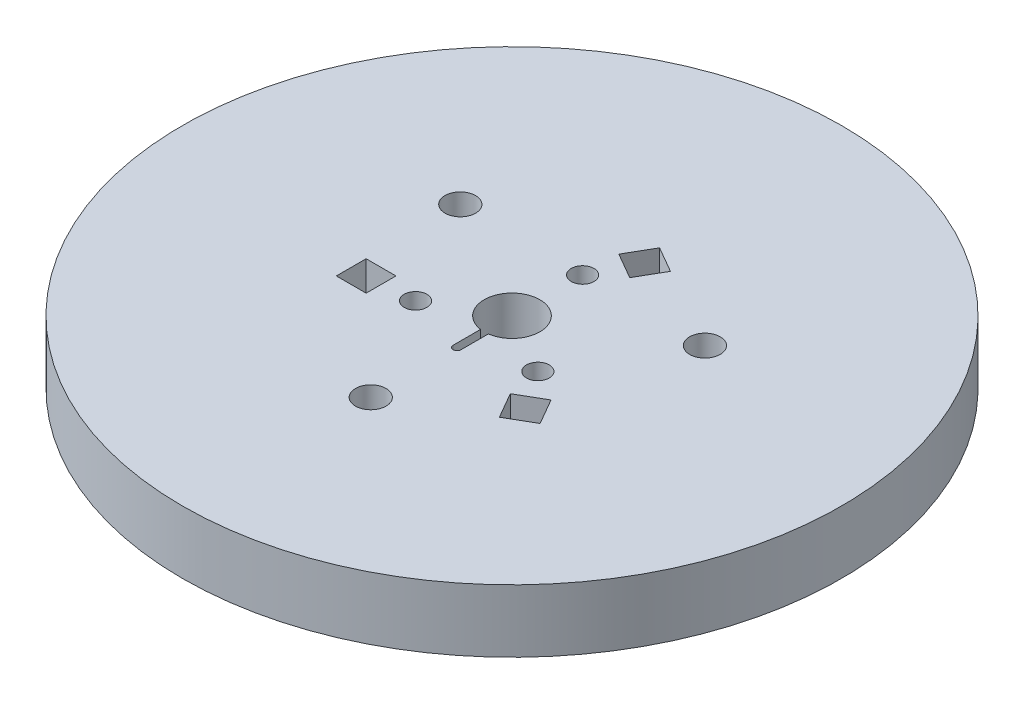
ISO-10303-21;
HEADER;
FILE_DESCRIPTION(('STEP AP214'),'2;1');
FILE_NAME('part.step','',(''),(''),'','','');
FILE_SCHEMA(('AUTOMOTIVE_DESIGN { 1 0 10303 214 1 1 1 1 }'));
ENDSEC;
DATA;
#1=APPLICATION_CONTEXT('core data for automotive mechanical design processes');
#2=APPLICATION_PROTOCOL_DEFINITION('international standard','automotive_design',2000,#1);
#3=PRODUCT_CONTEXT('',#1,'mechanical');
#4=PRODUCT('Part','Part','',(#3));
#5=PRODUCT_RELATED_PRODUCT_CATEGORY('part','',(#4));
#6=PRODUCT_DEFINITION_FORMATION('','',#4);
#7=PRODUCT_DEFINITION_CONTEXT('part definition',#1,'design');
#8=PRODUCT_DEFINITION('design','',#6,#7);
#9=PRODUCT_DEFINITION_SHAPE('','',#8);
#10=(LENGTH_UNIT() NAMED_UNIT(*) SI_UNIT(.MILLI.,.METRE.));
#11=(NAMED_UNIT(*) PLANE_ANGLE_UNIT() SI_UNIT($,.RADIAN.));
#12=(NAMED_UNIT(*) SI_UNIT($,.STERADIAN.) SOLID_ANGLE_UNIT());
#13=UNCERTAINTY_MEASURE_WITH_UNIT(LENGTH_MEASURE(1.E-05),#10,'distance_accuracy_value','');
#14=(GEOMETRIC_REPRESENTATION_CONTEXT(3) GLOBAL_UNCERTAINTY_ASSIGNED_CONTEXT((#13)) GLOBAL_UNIT_ASSIGNED_CONTEXT((#10,
#11,#12)) REPRESENTATION_CONTEXT('',''));
#15=CARTESIAN_POINT('',(0.,0.,0.));
#16=DIRECTION('',(0.,0.,1.));
#17=DIRECTION('',(1.,0.,0.));
#18=AXIS2_PLACEMENT_3D('',#15,#16,#17);
#19=CARTESIAN_POINT('',(0.,8.,0.));
#20=DIRECTION('',(0.,1.,0.));
#21=DIRECTION('',(0.,0.,-1.));
#22=AXIS2_PLACEMENT_3D('',#19,#20,#21);
#23=PLANE('',#22);
#24=DIRECTION('',(0.500000000000008,0.,-0.866025403784434));
#25=VECTOR('',#24,1.);
#26=CARTESIAN_POINT('',(1.90525588832576,8.,-16.9));
#27=LINE('',#26,#25);
#28=CARTESIAN_POINT('',(0.00525588832573222,8.,-13.6091034656191));
#29=VERTEX_POINT('',#28);
#30=CARTESIAN_POINT('',(1.90525588832576,8.,-16.9));
#31=VERTEX_POINT('',#30);
#32=EDGE_CURVE('E296',#29,#31,#27,.T.);
#33=ORIENTED_EDGE('',*,*,#32,.T.);
#34=DIRECTION('',(0.866025403784436,0.,0.500000000000005));
#35=VECTOR('',#34,1.);
#36=CARTESIAN_POINT('',(1.90525588832576,8.,-16.9));
#37=LINE('',#36,#35);
#38=CARTESIAN_POINT('',(5.19615242270662,8.,-15.));
#39=VERTEX_POINT('',#38);
#40=EDGE_CURVE('E270',#31,#39,#37,.T.);
#41=ORIENTED_EDGE('',*,*,#40,.T.);
#42=DIRECTION('',(-0.500000000000008,0.,0.866025403784434));
#43=VECTOR('',#42,1.);
#44=CARTESIAN_POINT('',(5.19615242270662,8.,-15.));
#45=LINE('',#44,#43);
#46=CARTESIAN_POINT('',(3.29615242270659,8.,-11.7091034656191));
#47=VERTEX_POINT('',#46);
#48=EDGE_CURVE('E277',#39,#47,#45,.T.);
#49=ORIENTED_EDGE('',*,*,#48,.T.);
#50=DIRECTION('',(-0.866025403784436,0.,-0.500000000000004));
#51=VECTOR('',#50,1.);
#52=CARTESIAN_POINT('',(0.00525588832573222,8.,-13.6091034656191));
#53=LINE('',#52,#51);
#54=EDGE_CURVE('E272',#47,#29,#53,.T.);
#55=ORIENTED_EDGE('',*,*,#54,.T.);
#56=EDGE_LOOP('',(#33,#41,#49,#55));
#57=FACE_BOUND('',#56,.T.);
#58=DIRECTION('',(-1.,0.,0.));
#59=VECTOR('',#58,1.);
#60=CARTESIAN_POINT('',(-15.5884572681199,8.,6.80000000000006));
#61=LINE('',#60,#59);
#62=CARTESIAN_POINT('',(-11.7884572681199,8.,6.80000000000008));
#63=VERTEX_POINT('',#62);
#64=CARTESIAN_POINT('',(-15.5884572681199,8.,6.80000000000006));
#65=VERTEX_POINT('',#64);
#66=EDGE_CURVE('E281',#63,#65,#61,.T.);
#67=ORIENTED_EDGE('',*,*,#66,.T.);
#68=DIRECTION('',(0.,0.,-1.));
#69=VECTOR('',#68,1.);
#70=CARTESIAN_POINT('',(-15.5884572681199,8.,6.80000000000006));
#71=LINE('',#70,#69);
#72=CARTESIAN_POINT('',(-15.5884572681199,8.,3.00000000000006));
#73=VERTEX_POINT('',#72);
#74=EDGE_CURVE('E284',#65,#73,#71,.T.);
#75=ORIENTED_EDGE('',*,*,#74,.T.);
#76=DIRECTION('',(1.,0.,0.));
#77=VECTOR('',#76,1.);
#78=CARTESIAN_POINT('',(-15.5884572681199,8.,3.00000000000006));
#79=LINE('',#78,#77);
#80=CARTESIAN_POINT('',(-11.7884572681199,8.,3.00000000000008));
#81=VERTEX_POINT('',#80);
#82=EDGE_CURVE('E288',#73,#81,#79,.T.);
#83=ORIENTED_EDGE('',*,*,#82,.T.);
#84=DIRECTION('',(0.,0.,1.));
#85=VECTOR('',#84,1.);
#86=CARTESIAN_POINT('',(-11.7884572681199,8.,6.80000000000008));
#87=LINE('',#86,#85);
#88=EDGE_CURVE('E291',#81,#63,#87,.T.);
#89=ORIENTED_EDGE('',*,*,#88,.T.);
#90=EDGE_LOOP('',(#67,#75,#83,#89));
#91=FACE_BOUND('',#90,.T.);
#92=DIRECTION('',(0.5,0.,0.866025403784439));
#93=VECTOR('',#92,1.);
#94=CARTESIAN_POINT('',(13.6832013797942,8.,10.0999999999999));
#95=LINE('',#94,#93);
#96=CARTESIAN_POINT('',(11.7832013797942,8.,6.80910346561901));
#97=VERTEX_POINT('',#96);
#98=CARTESIAN_POINT('',(13.6832013797942,8.,10.0999999999999));
#99=VERTEX_POINT('',#98);
#100=EDGE_CURVE('E302',#97,#99,#95,.T.);
#101=ORIENTED_EDGE('',*,*,#100,.T.);
#102=DIRECTION('',(-0.866025403784436,0.,0.500000000000004));
#103=VECTOR('',#102,1.);
#104=CARTESIAN_POINT('',(13.6832013797942,8.,10.0999999999999));
#105=LINE('',#104,#103);
#106=CARTESIAN_POINT('',(10.3923048454134,8.,11.9999999999999));
#107=VERTEX_POINT('',#106);
#108=EDGE_CURVE('E305',#99,#107,#105,.T.);
#109=ORIENTED_EDGE('',*,*,#108,.T.);
#110=DIRECTION('',(-0.5,0.,-0.866025403784439));
#111=VECTOR('',#110,1.);
#112=CARTESIAN_POINT('',(10.3923048454134,8.,11.9999999999999));
#113=LINE('',#112,#111);
#114=CARTESIAN_POINT('',(8.49230484541335,8.,8.70910346561902));
#115=VERTEX_POINT('',#114);
#116=EDGE_CURVE('E309',#107,#115,#113,.T.);
#117=ORIENTED_EDGE('',*,*,#116,.T.);
#118=DIRECTION('',(0.866025403784437,0.,-0.500000000000003));
#119=VECTOR('',#118,1.);
#120=CARTESIAN_POINT('',(11.7832013797942,8.,6.80910346561901));
#121=LINE('',#120,#119);
#122=EDGE_CURVE('E312',#115,#97,#121,.T.);
#123=ORIENTED_EDGE('',*,*,#122,.T.);
#124=EDGE_LOOP('',(#101,#109,#117,#123));
#125=FACE_BOUND('',#124,.T.);
#126=DIRECTION('',(0.,0.,1.));
#127=VECTOR('',#126,1.);
#128=CARTESIAN_POINT('',(0.499999999999999,8.,7.));
#129=LINE('',#128,#127);
#130=CARTESIAN_POINT('',(0.499999999999999,8.,3.51461235415799));
#131=VERTEX_POINT('',#130);
#132=CARTESIAN_POINT('',(0.499999999999999,8.,7.));
#133=VERTEX_POINT('',#132);
#134=EDGE_CURVE('E184',#131,#133,#129,.T.);
#135=ORIENTED_EDGE('',*,*,#134,.T.);
#136=CARTESIAN_POINT('',(0.,8.,7.));
#137=DIRECTION('',(0.,-1.,0.));
#138=DIRECTION('',(0.,0.,-1.));
#139=AXIS2_PLACEMENT_3D('',#136,#137,#138);
#140=CIRCLE('',#139,0.499999999999999);
#141=CARTESIAN_POINT('',(-0.499999999999999,8.,7.));
#142=VERTEX_POINT('',#141);
#143=EDGE_CURVE('E176',#133,#142,#140,.T.);
#144=ORIENTED_EDGE('',*,*,#143,.T.);
#145=DIRECTION('',(0.,0.,-1.));
#146=VECTOR('',#145,1.);
#147=CARTESIAN_POINT('',(-0.499999999999999,8.,7.));
#148=LINE('',#147,#146);
#149=CARTESIAN_POINT('',(-0.499999999999998,8.,3.51461235415799));
#150=VERTEX_POINT('',#149);
#151=EDGE_CURVE('E322',#142,#150,#148,.T.);
#152=ORIENTED_EDGE('',*,*,#151,.T.);
#153=CARTESIAN_POINT('',(0.,8.,0.));
#154=DIRECTION('',(0.,-1.,0.));
#155=DIRECTION('',(0.,0.,-1.));
#156=AXIS2_PLACEMENT_3D('',#153,#154,#155);
#157=CIRCLE('',#156,3.55);
#158=EDGE_CURVE('E201',#150,#131,#157,.T.);
#159=ORIENTED_EDGE('',*,*,#158,.T.);
#160=EDGE_LOOP('',(#135,#144,#152,#159));
#161=FACE_BOUND('',#160,.T.);
#162=CARTESIAN_POINT('',(0.,8.,-9.));
#163=DIRECTION('',(0.,-1.,0.));
#164=DIRECTION('',(0.,0.,-1.));
#165=AXIS2_PLACEMENT_3D('',#162,#163,#164);
#166=CIRCLE('',#165,1.45);
#167=CARTESIAN_POINT('',(0.,8.,-10.45));
#168=VERTEX_POINT('',#167);
#169=EDGE_CURVE('E182',#168,#168,#166,.T.);
#170=ORIENTED_EDGE('',*,*,#169,.T.);
#171=EDGE_LOOP('',(#170));
#172=FACE_BOUND('',#171,.T.);
#173=CARTESIAN_POINT('',(15.5884572681197,8.,-9.00000000000029));
#174=DIRECTION('',(0.,-1.,0.));
#175=DIRECTION('',(0.,0.,-1.));
#176=AXIS2_PLACEMENT_3D('',#173,#174,#175);
#177=CIRCLE('',#176,1.95);
#178=CARTESIAN_POINT('',(15.5884572681197,8.,-10.9500000000003));
#179=VERTEX_POINT('',#178);
#180=EDGE_CURVE('E198',#179,#179,#177,.T.);
#181=ORIENTED_EDGE('',*,*,#180,.T.);
#182=EDGE_LOOP('',(#181));
#183=FACE_BOUND('',#182,.T.);
#184=CARTESIAN_POINT('',(7.79422863405996,8.,4.49999999999998));
#185=DIRECTION('',(0.,-1.,0.));
#186=DIRECTION('',(0.,0.,-1.));
#187=AXIS2_PLACEMENT_3D('',#184,#185,#186);
#188=CIRCLE('',#187,1.45);
#189=CARTESIAN_POINT('',(7.79422863405996,8.,3.04999999999998));
#190=VERTEX_POINT('',#189);
#191=EDGE_CURVE('E206',#190,#190,#188,.T.);
#192=ORIENTED_EDGE('',*,*,#191,.T.);
#193=EDGE_LOOP('',(#192));
#194=FACE_BOUND('',#193,.T.);
#195=CARTESIAN_POINT('',(0.,8.,0.));
#196=DIRECTION('',(0.,-1.,0.));
#197=DIRECTION('',(0.,0.,-1.));
#198=AXIS2_PLACEMENT_3D('',#195,#196,#197);
#199=CIRCLE('',#198,42.);
#200=CARTESIAN_POINT('',(0.,8.,-42.));
#201=VERTEX_POINT('',#200);
#202=EDGE_CURVE('E216',#201,#201,#199,.T.);
#203=ORIENTED_EDGE('',*,*,#202,.F.);
#204=EDGE_LOOP('',(#203));
#205=FACE_BOUND('',#204,.T.);
#206=CARTESIAN_POINT('',(0.,8.,18.));
#207=DIRECTION('',(0.,-1.,0.));
#208=DIRECTION('',(0.,0.,-1.));
#209=AXIS2_PLACEMENT_3D('',#206,#207,#208);
#210=CIRCLE('',#209,1.95);
#211=CARTESIAN_POINT('',(0.,8.,16.05));
#212=VERTEX_POINT('',#211);
#213=EDGE_CURVE('E210',#212,#212,#210,.T.);
#214=ORIENTED_EDGE('',*,*,#213,.T.);
#215=EDGE_LOOP('',(#214));
#216=FACE_BOUND('',#215,.T.);
#217=CARTESIAN_POINT('',(-15.5884572681201,8.,-8.99999999999964));
#218=DIRECTION('',(0.,-1.,0.));
#219=DIRECTION('',(0.,0.,-1.));
#220=AXIS2_PLACEMENT_3D('',#217,#218,#219);
#221=CIRCLE('',#220,1.95);
#222=CARTESIAN_POINT('',(-15.5884572681201,8.,-10.9499999999996));
#223=VERTEX_POINT('',#222);
#224=EDGE_CURVE('E192',#223,#223,#221,.T.);
#225=ORIENTED_EDGE('',*,*,#224,.T.);
#226=EDGE_LOOP('',(#225));
#227=FACE_BOUND('',#226,.T.);
#228=CARTESIAN_POINT('',(-7.79422863405989,8.,4.50000000000009));
#229=DIRECTION('',(0.,-1.,0.));
#230=DIRECTION('',(0.,0.,-1.));
#231=AXIS2_PLACEMENT_3D('',#228,#229,#230);
#232=CIRCLE('',#231,1.45);
#233=CARTESIAN_POINT('',(-7.79422863405989,8.,3.05000000000009));
#234=VERTEX_POINT('',#233);
#235=EDGE_CURVE('E178',#234,#234,#232,.T.);
#236=ORIENTED_EDGE('',*,*,#235,.T.);
#237=EDGE_LOOP('',(#236));
#238=FACE_BOUND('',#237,.T.);
#239=ADVANCED_FACE('F37',(#57,#91,#125,#161,#172,#183,#194,#205,#216,#227,#238),#23,.T.);
#240=CARTESIAN_POINT('',(0.,0.,0.));
#241=DIRECTION('',(0.,1.,0.));
#242=DIRECTION('',(0.,0.,-1.));
#243=AXIS2_PLACEMENT_3D('',#240,#241,#242);
#244=PLANE('',#243);
#245=CARTESIAN_POINT('',(0.,0.,0.));
#246=DIRECTION('',(0.,1.,0.));
#247=DIRECTION('',(0.,0.,1.));
#248=AXIS2_PLACEMENT_3D('',#245,#246,#247);
#249=CIRCLE('',#248,12.);
#250=CARTESIAN_POINT('',(0.,0.,12.));
#251=VERTEX_POINT('',#250);
#252=EDGE_CURVE('E11',#251,#251,#249,.T.);
#253=ORIENTED_EDGE('',*,*,#252,.T.);
#254=EDGE_LOOP('',(#253));
#255=FACE_BOUND('',#254,.T.);
#256=DIRECTION('',(-0.866025403784436,0.,-0.500000000000004));
#257=VECTOR('',#256,1.);
#258=CARTESIAN_POINT('',(5.89422863405998,0.,-10.2091034656191));
#259=LINE('',#258,#257);
#260=CARTESIAN_POINT('',(3.29615242270659,0.,-11.7091034656191));
#261=VERTEX_POINT('',#260);
#262=CARTESIAN_POINT('',(0.00525588832573222,0.,-13.6091034656191));
#263=VERTEX_POINT('',#262);
#264=EDGE_CURVE('E253',#261,#263,#259,.T.);
#265=ORIENTED_EDGE('',*,*,#264,.F.);
#266=DIRECTION('',(-0.500000000000008,0.,0.866025403784434));
#267=VECTOR('',#266,1.);
#268=CARTESIAN_POINT('',(-2.59807621135342,0.,-1.50000000000009));
#269=LINE('',#268,#267);
#270=CARTESIAN_POINT('',(5.19615242270662,0.,-15.));
#271=VERTEX_POINT('',#270);
#272=EDGE_CURVE('E251',#271,#261,#269,.T.);
#273=ORIENTED_EDGE('',*,*,#272,.F.);
#274=DIRECTION('',(0.866025403784436,0.,0.500000000000005));
#275=VECTOR('',#274,1.);
#276=CARTESIAN_POINT('',(7.79422863406001,0.,-13.4999999999999));
#277=LINE('',#276,#275);
#278=CARTESIAN_POINT('',(1.90525588832576,0.,-16.9));
#279=VERTEX_POINT('',#278);
#280=EDGE_CURVE('E248',#279,#271,#277,.T.);
#281=ORIENTED_EDGE('',*,*,#280,.F.);
#282=DIRECTION('',(0.500000000000008,0.,-0.866025403784434));
#283=VECTOR('',#282,1.);
#284=CARTESIAN_POINT('',(-5.88897274573427,0.,-3.40000000000012));
#285=LINE('',#284,#283);
#286=EDGE_CURVE('E41',#263,#279,#285,.T.);
#287=ORIENTED_EDGE('',*,*,#286,.F.);
#288=EDGE_LOOP('',(#265,#273,#281,#287));
#289=FACE_BOUND('',#288,.T.);
#290=DIRECTION('',(0.,0.,1.));
#291=VECTOR('',#290,1.);
#292=CARTESIAN_POINT('',(-11.7884572681198,0.,0.));
#293=LINE('',#292,#291);
#294=CARTESIAN_POINT('',(-11.7884572681199,0.,3.00000000000008));
#295=VERTEX_POINT('',#294);
#296=CARTESIAN_POINT('',(-11.7884572681199,0.,6.80000000000008));
#297=VERTEX_POINT('',#296);
#298=EDGE_CURVE('E243',#295,#297,#293,.T.);
#299=ORIENTED_EDGE('',*,*,#298,.F.);
#300=DIRECTION('',(1.,0.,0.));
#301=VECTOR('',#300,1.);
#302=CARTESIAN_POINT('',(0.,0.,3.00000000000013));
#303=LINE('',#302,#301);
#304=CARTESIAN_POINT('',(-15.5884572681199,0.,3.00000000000006));
#305=VERTEX_POINT('',#304);
#306=EDGE_CURVE('E240',#305,#295,#303,.T.);
#307=ORIENTED_EDGE('',*,*,#306,.F.);
#308=DIRECTION('',(0.,0.,-1.));
#309=VECTOR('',#308,1.);
#310=CARTESIAN_POINT('',(-15.5884572681199,0.,0.));
#311=LINE('',#310,#309);
#312=CARTESIAN_POINT('',(-15.5884572681199,0.,6.80000000000006));
#313=VERTEX_POINT('',#312);
#314=EDGE_CURVE('E237',#313,#305,#311,.T.);
#315=ORIENTED_EDGE('',*,*,#314,.F.);
#316=DIRECTION('',(-1.,0.,0.));
#317=VECTOR('',#316,1.);
#318=CARTESIAN_POINT('',(0.,0.,6.80000000000013));
#319=LINE('',#318,#317);
#320=EDGE_CURVE('E246',#297,#313,#319,.T.);
#321=ORIENTED_EDGE('',*,*,#320,.F.);
#322=EDGE_LOOP('',(#299,#307,#315,#321));
#323=FACE_BOUND('',#322,.T.);
#324=DIRECTION('',(0.866025403784437,0.,-0.500000000000003));
#325=VECTOR('',#324,1.);
#326=CARTESIAN_POINT('',(5.89422863405996,0.,10.2091034656191));
#327=LINE('',#326,#325);
#328=CARTESIAN_POINT('',(8.49230484541335,0.,8.70910346561902));
#329=VERTEX_POINT('',#328);
#330=CARTESIAN_POINT('',(11.7832013797942,0.,6.80910346561901));
#331=VERTEX_POINT('',#330);
#332=EDGE_CURVE('E231',#329,#331,#327,.T.);
#333=ORIENTED_EDGE('',*,*,#332,.F.);
#334=DIRECTION('',(-0.5,0.,-0.866025403784439));
#335=VECTOR('',#334,1.);
#336=CARTESIAN_POINT('',(2.59807621135343,0.,-1.50000000000006));
#337=LINE('',#336,#335);
#338=CARTESIAN_POINT('',(10.3923048454134,0.,11.9999999999999));
#339=VERTEX_POINT('',#338);
#340=EDGE_CURVE('E228',#339,#329,#337,.T.);
#341=ORIENTED_EDGE('',*,*,#340,.F.);
#342=DIRECTION('',(-0.866025403784436,0.,0.500000000000004));
#343=VECTOR('',#342,1.);
#344=CARTESIAN_POINT('',(7.79422863406,0.,13.4999999999999));
#345=LINE('',#344,#343);
#346=CARTESIAN_POINT('',(13.6832013797942,0.,10.0999999999999));
#347=VERTEX_POINT('',#346);
#348=EDGE_CURVE('E225',#347,#339,#345,.T.);
#349=ORIENTED_EDGE('',*,*,#348,.F.);
#350=DIRECTION('',(0.5,0.,0.866025403784439));
#351=VECTOR('',#350,1.);
#352=CARTESIAN_POINT('',(5.88897274573429,0.,-3.40000000000007));
#353=LINE('',#352,#351);
#354=EDGE_CURVE('E234',#331,#347,#353,.T.);
#355=ORIENTED_EDGE('',*,*,#354,.F.);
#356=EDGE_LOOP('',(#333,#341,#349,#355));
#357=FACE_BOUND('',#356,.T.);
#358=CARTESIAN_POINT('',(0.,0.,0.));
#359=DIRECTION('',(0.,-1.,0.));
#360=DIRECTION('',(0.,0.,-1.));
#361=AXIS2_PLACEMENT_3D('',#358,#359,#360);
#362=CIRCLE('',#361,42.);
#363=CARTESIAN_POINT('',(0.,0.,-42.));
#364=VERTEX_POINT('',#363);
#365=EDGE_CURVE('E213',#364,#364,#362,.T.);
#366=ORIENTED_EDGE('',*,*,#365,.T.);
#367=EDGE_LOOP('',(#366));
#368=FACE_BOUND('',#367,.T.);
#369=CARTESIAN_POINT('',(0.,0.,18.));
#370=DIRECTION('',(0.,-1.,0.));
#371=DIRECTION('',(0.,0.,-1.));
#372=AXIS2_PLACEMENT_3D('',#369,#370,#371);
#373=CIRCLE('',#372,1.95);
#374=CARTESIAN_POINT('',(0.,0.,16.05));
#375=VERTEX_POINT('',#374);
#376=EDGE_CURVE('E209',#375,#375,#373,.T.);
#377=ORIENTED_EDGE('',*,*,#376,.F.);
#378=EDGE_LOOP('',(#377));
#379=FACE_BOUND('',#378,.T.);
#380=CARTESIAN_POINT('',(15.5884572681197,0.,-9.00000000000029));
#381=DIRECTION('',(0.,-1.,0.));
#382=DIRECTION('',(0.,0.,-1.));
#383=AXIS2_PLACEMENT_3D('',#380,#381,#382);
#384=CIRCLE('',#383,1.95);
#385=CARTESIAN_POINT('',(15.5884572681197,0.,-10.9500000000003));
#386=VERTEX_POINT('',#385);
#387=EDGE_CURVE('E195',#386,#386,#384,.T.);
#388=ORIENTED_EDGE('',*,*,#387,.F.);
#389=EDGE_LOOP('',(#388));
#390=FACE_BOUND('',#389,.T.);
#391=CARTESIAN_POINT('',(-15.5884572681201,0.,-8.99999999999964));
#392=DIRECTION('',(0.,-1.,0.));
#393=DIRECTION('',(0.,0.,-1.));
#394=AXIS2_PLACEMENT_3D('',#391,#392,#393);
#395=CIRCLE('',#394,1.95);
#396=CARTESIAN_POINT('',(-15.5884572681201,0.,-10.9499999999996));
#397=VERTEX_POINT('',#396);
#398=EDGE_CURVE('E191',#397,#397,#395,.T.);
#399=ORIENTED_EDGE('',*,*,#398,.F.);
#400=EDGE_LOOP('',(#399));
#401=FACE_BOUND('',#400,.T.);
#402=ADVANCED_FACE('F263',(#255,#289,#323,#357,#368,#379,#390,#401),#244,.F.);
#403=CARTESIAN_POINT('',(0.,8.,0.));
#404=DIRECTION('',(0.,-1.,0.));
#405=DIRECTION('',(0.,0.,1.));
#406=AXIS2_PLACEMENT_3D('',#403,#404,#405);
#407=CYLINDRICAL_SURFACE('',#406,42.);
#408=ORIENTED_EDGE('',*,*,#202,.T.);
#409=EDGE_LOOP('',(#408));
#410=FACE_BOUND('',#409,.T.);
#411=ORIENTED_EDGE('',*,*,#365,.F.);
#412=EDGE_LOOP('',(#411));
#413=FACE_BOUND('',#412,.T.);
#414=ADVANCED_FACE('F39',(#410,#413),#407,.T.);
#415=CARTESIAN_POINT('',(0.,8.,18.));
#416=DIRECTION('',(0.,-1.,0.));
#417=DIRECTION('',(0.,0.,1.));
#418=AXIS2_PLACEMENT_3D('',#415,#416,#417);
#419=CYLINDRICAL_SURFACE('',#418,1.95);
#420=ORIENTED_EDGE('',*,*,#213,.F.);
#421=EDGE_LOOP('',(#420));
#422=FACE_BOUND('',#421,.T.);
#423=ORIENTED_EDGE('',*,*,#376,.T.);
#424=EDGE_LOOP('',(#423));
#425=FACE_BOUND('',#424,.T.);
#426=ADVANCED_FACE('F399',(#422,#425),#419,.F.);
#427=CARTESIAN_POINT('',(7.79422863405996,8.,4.49999999999998));
#428=DIRECTION('',(0.,-1.,0.));
#429=DIRECTION('',(0.,0.,1.));
#430=AXIS2_PLACEMENT_3D('',#427,#428,#429);
#431=CYLINDRICAL_SURFACE('',#430,1.45);
#432=ORIENTED_EDGE('',*,*,#191,.F.);
#433=EDGE_LOOP('',(#432));
#434=FACE_BOUND('',#433,.T.);
#435=CARTESIAN_POINT('',(7.79422863405996,-3.,4.49999999999998));
#436=DIRECTION('',(0.,1.,0.));
#437=DIRECTION('',(0.,0.,1.));
#438=AXIS2_PLACEMENT_3D('',#435,#436,#437);
#439=CIRCLE('',#438,1.45);
#440=CARTESIAN_POINT('',(7.79422863405996,-3.,5.94999999999998));
#441=VERTEX_POINT('',#440);
#442=EDGE_CURVE('E420',#441,#441,#439,.T.);
#443=ORIENTED_EDGE('',*,*,#442,.F.);
#444=EDGE_LOOP('',(#443));
#445=FACE_BOUND('',#444,.T.);
#446=ADVANCED_FACE('F396',(#434,#445),#431,.F.);
#447=CARTESIAN_POINT('',(0.,8.,0.));
#448=DIRECTION('',(0.,-1.,0.));
#449=DIRECTION('',(0.,0.,1.));
#450=AXIS2_PLACEMENT_3D('',#447,#448,#449);
#451=CYLINDRICAL_SURFACE('',#450,3.55);
#452=DIRECTION('',(0.,-1.,0.));
#453=VECTOR('',#452,1.);
#454=CARTESIAN_POINT('',(0.499999999999999,8.,3.51461235415799));
#455=LINE('',#454,#453);
#456=CARTESIAN_POINT('',(0.499999999999999,-3.,3.51461235415799));
#457=VERTEX_POINT('',#456);
#458=EDGE_CURVE('E159',#457,#131,#455,.F.);
#459=ORIENTED_EDGE('',*,*,#458,.T.);
#460=ORIENTED_EDGE('',*,*,#158,.F.);
#461=DIRECTION('',(0.,-1.,0.));
#462=VECTOR('',#461,1.);
#463=CARTESIAN_POINT('',(-0.499999999999998,8.,3.51461235415799));
#464=LINE('',#463,#462);
#465=CARTESIAN_POINT('',(-0.499999999999998,-3.,3.51461235415799));
#466=VERTEX_POINT('',#465);
#467=EDGE_CURVE('E219',#150,#466,#464,.T.);
#468=ORIENTED_EDGE('',*,*,#467,.T.);
#469=CARTESIAN_POINT('',(0.,-3.,0.));
#470=DIRECTION('',(0.,1.,0.));
#471=DIRECTION('',(0.,0.,1.));
#472=AXIS2_PLACEMENT_3D('',#469,#470,#471);
#473=CIRCLE('',#472,3.55);
#474=EDGE_CURVE('E163',#457,#466,#473,.T.);
#475=ORIENTED_EDGE('',*,*,#474,.F.);
#476=EDGE_LOOP('',(#459,#460,#468,#475));
#477=FACE_BOUND('',#476,.T.);
#478=ADVANCED_FACE('F329',(#477),#451,.F.);
#479=CARTESIAN_POINT('',(15.5884572681197,8.,-9.00000000000029));
#480=DIRECTION('',(0.,-1.,0.));
#481=DIRECTION('',(0.,0.,1.));
#482=AXIS2_PLACEMENT_3D('',#479,#480,#481);
#483=CYLINDRICAL_SURFACE('',#482,1.95);
#484=ORIENTED_EDGE('',*,*,#180,.F.);
#485=EDGE_LOOP('',(#484));
#486=FACE_BOUND('',#485,.T.);
#487=ORIENTED_EDGE('',*,*,#387,.T.);
#488=EDGE_LOOP('',(#487));
#489=FACE_BOUND('',#488,.T.);
#490=ADVANCED_FACE('F379',(#486,#489),#483,.F.);
#491=CARTESIAN_POINT('',(-15.5884572681201,8.,-8.99999999999964));
#492=DIRECTION('',(0.,-1.,0.));
#493=DIRECTION('',(0.,0.,1.));
#494=AXIS2_PLACEMENT_3D('',#491,#492,#493);
#495=CYLINDRICAL_SURFACE('',#494,1.95);
#496=ORIENTED_EDGE('',*,*,#224,.F.);
#497=EDGE_LOOP('',(#496));
#498=FACE_BOUND('',#497,.T.);
#499=ORIENTED_EDGE('',*,*,#398,.T.);
#500=EDGE_LOOP('',(#499));
#501=FACE_BOUND('',#500,.T.);
#502=ADVANCED_FACE('F376',(#498,#501),#495,.F.);
#503=CARTESIAN_POINT('',(0.,8.,-9.));
#504=DIRECTION('',(0.,-1.,0.));
#505=DIRECTION('',(0.,0.,1.));
#506=AXIS2_PLACEMENT_3D('',#503,#504,#505);
#507=CYLINDRICAL_SURFACE('',#506,1.45);
#508=ORIENTED_EDGE('',*,*,#169,.F.);
#509=EDGE_LOOP('',(#508));
#510=FACE_BOUND('',#509,.T.);
#511=CARTESIAN_POINT('',(0.,-3.,-9.));
#512=DIRECTION('',(0.,1.,0.));
#513=DIRECTION('',(0.,0.,1.));
#514=AXIS2_PLACEMENT_3D('',#511,#512,#513);
#515=CIRCLE('',#514,1.45);
#516=CARTESIAN_POINT('',(0.,-3.,-7.55));
#517=VERTEX_POINT('',#516);
#518=EDGE_CURVE('E172',#517,#517,#515,.T.);
#519=ORIENTED_EDGE('',*,*,#518,.F.);
#520=EDGE_LOOP('',(#519));
#521=FACE_BOUND('',#520,.T.);
#522=ADVANCED_FACE('F378',(#510,#521),#507,.F.);
#523=CARTESIAN_POINT('',(-7.79422863405989,8.,4.50000000000009));
#524=DIRECTION('',(0.,-1.,0.));
#525=DIRECTION('',(0.,0.,1.));
#526=AXIS2_PLACEMENT_3D('',#523,#524,#525);
#527=CYLINDRICAL_SURFACE('',#526,1.45);
#528=ORIENTED_EDGE('',*,*,#235,.F.);
#529=EDGE_LOOP('',(#528));
#530=FACE_BOUND('',#529,.T.);
#531=CARTESIAN_POINT('',(-7.79422863405989,-3.,4.50000000000009));
#532=DIRECTION('',(0.,1.,0.));
#533=DIRECTION('',(0.,0.,1.));
#534=AXIS2_PLACEMENT_3D('',#531,#532,#533);
#535=CIRCLE('',#534,1.45);
#536=CARTESIAN_POINT('',(-7.79422863405989,-3.,5.95000000000009));
#537=VERTEX_POINT('',#536);
#538=EDGE_CURVE('E418',#537,#537,#535,.T.);
#539=ORIENTED_EDGE('',*,*,#538,.F.);
#540=EDGE_LOOP('',(#539));
#541=FACE_BOUND('',#540,.T.);
#542=ADVANCED_FACE('F386',(#530,#541),#527,.F.);
#543=CARTESIAN_POINT('',(0.,-2.,7.));
#544=DIRECTION('',(0.,1.,0.));
#545=DIRECTION('',(0.,0.,-1.));
#546=AXIS2_PLACEMENT_3D('',#543,#544,#545);
#547=CYLINDRICAL_SURFACE('',#546,0.499999999999999);
#548=DIRECTION('',(0.,1.,0.));
#549=VECTOR('',#548,1.);
#550=CARTESIAN_POINT('',(0.499999999999999,-2.,7.));
#551=LINE('',#550,#549);
#552=CARTESIAN_POINT('',(0.499999999999999,-3.,7.));
#553=VERTEX_POINT('',#552);
#554=EDGE_CURVE('E157',#553,#133,#551,.T.);
#555=ORIENTED_EDGE('',*,*,#554,.F.);
#556=CARTESIAN_POINT('',(0.,-3.,7.));
#557=DIRECTION('',(0.,1.,0.));
#558=DIRECTION('',(0.,0.,1.));
#559=AXIS2_PLACEMENT_3D('',#556,#557,#558);
#560=CIRCLE('',#559,0.499999999999999);
#561=CARTESIAN_POINT('',(-0.499999999999999,-3.,7.));
#562=VERTEX_POINT('',#561);
#563=EDGE_CURVE('E164',#562,#553,#560,.T.);
#564=ORIENTED_EDGE('',*,*,#563,.F.);
#565=DIRECTION('',(0.,1.,0.));
#566=VECTOR('',#565,1.);
#567=CARTESIAN_POINT('',(-0.499999999999999,-2.,7.));
#568=LINE('',#567,#566);
#569=EDGE_CURVE('E179',#562,#142,#568,.T.);
#570=ORIENTED_EDGE('',*,*,#569,.T.);
#571=ORIENTED_EDGE('',*,*,#143,.F.);
#572=EDGE_LOOP('',(#555,#564,#570,#571));
#573=FACE_BOUND('',#572,.T.);
#574=ADVANCED_FACE('F174',(#573),#547,.F.);
#575=CARTESIAN_POINT('',(0.499999999999999,-2.,7.));
#576=DIRECTION('',(1.,0.,0.));
#577=DIRECTION('',(0.,0.,1.));
#578=AXIS2_PLACEMENT_3D('',#575,#576,#577);
#579=PLANE('',#578);
#580=ORIENTED_EDGE('',*,*,#458,.F.);
#581=DIRECTION('',(0.,0.,-1.));
#582=VECTOR('',#581,1.);
#583=CARTESIAN_POINT('',(0.499999999999999,-3.,3.51461235415799));
#584=LINE('',#583,#582);
#585=EDGE_CURVE('E152',#553,#457,#584,.T.);
#586=ORIENTED_EDGE('',*,*,#585,.F.);
#587=ORIENTED_EDGE('',*,*,#554,.T.);
#588=ORIENTED_EDGE('',*,*,#134,.F.);
#589=EDGE_LOOP('',(#580,#586,#587,#588));
#590=FACE_BOUND('',#589,.T.);
#591=ADVANCED_FACE('F154',(#590),#579,.F.);
#592=CARTESIAN_POINT('',(-0.499999999999999,-2.,7.));
#593=DIRECTION('',(-1.,0.,0.));
#594=DIRECTION('',(0.,0.,-1.));
#595=AXIS2_PLACEMENT_3D('',#592,#593,#594);
#596=PLANE('',#595);
#597=ORIENTED_EDGE('',*,*,#569,.F.);
#598=DIRECTION('',(0.,0.,1.));
#599=VECTOR('',#598,1.);
#600=CARTESIAN_POINT('',(-0.499999999999999,-3.,7.));
#601=LINE('',#600,#599);
#602=EDGE_CURVE('E169',#466,#562,#601,.T.);
#603=ORIENTED_EDGE('',*,*,#602,.F.);
#604=ORIENTED_EDGE('',*,*,#467,.F.);
#605=ORIENTED_EDGE('',*,*,#151,.F.);
#606=EDGE_LOOP('',(#597,#603,#604,#605));
#607=FACE_BOUND('',#606,.T.);
#608=ADVANCED_FACE('F469',(#607),#596,.F.);
#609=CARTESIAN_POINT('',(13.6832013797942,-27.,10.0999999999999));
#610=DIRECTION('',(0.866025403784439,0.,-0.5));
#611=DIRECTION('',(0.5,0.,0.866025403784439));
#612=AXIS2_PLACEMENT_3D('',#609,#610,#611);
#613=PLANE('',#612);
#614=DIRECTION('',(0.,1.,0.));
#615=VECTOR('',#614,1.);
#616=CARTESIAN_POINT('',(11.7832013797942,-27.,6.80910346561901));
#617=LINE('',#616,#615);
#618=EDGE_CURVE('E285',#331,#97,#617,.T.);
#619=ORIENTED_EDGE('',*,*,#618,.F.);
#620=ORIENTED_EDGE('',*,*,#354,.T.);
#621=DIRECTION('',(0.,1.,0.));
#622=VECTOR('',#621,1.);
#623=CARTESIAN_POINT('',(13.6832013797942,-27.,10.0999999999999));
#624=LINE('',#623,#622);
#625=EDGE_CURVE('E315',#347,#99,#624,.T.);
#626=ORIENTED_EDGE('',*,*,#625,.T.);
#627=ORIENTED_EDGE('',*,*,#100,.F.);
#628=EDGE_LOOP('',(#619,#620,#626,#627));
#629=FACE_BOUND('',#628,.T.);
#630=ADVANCED_FACE('F352',(#629),#613,.F.);
#631=CARTESIAN_POINT('',(11.7832013797942,-27.,6.80910346561901));
#632=DIRECTION('',(-0.500000000000003,0.,-0.866025403784437));
#633=DIRECTION('',(0.866025403784437,0.,-0.500000000000003));
#634=AXIS2_PLACEMENT_3D('',#631,#632,#633);
#635=PLANE('',#634);
#636=DIRECTION('',(0.,1.,0.));
#637=VECTOR('',#636,1.);
#638=CARTESIAN_POINT('',(8.49230484541335,-27.,8.70910346561902));
#639=LINE('',#638,#637);
#640=EDGE_CURVE('E317',#329,#115,#639,.T.);
#641=ORIENTED_EDGE('',*,*,#640,.F.);
#642=ORIENTED_EDGE('',*,*,#332,.T.);
#643=ORIENTED_EDGE('',*,*,#618,.T.);
#644=ORIENTED_EDGE('',*,*,#122,.F.);
#645=EDGE_LOOP('',(#641,#642,#643,#644));
#646=FACE_BOUND('',#645,.T.);
#647=ADVANCED_FACE('F363',(#646),#635,.F.);
#648=CARTESIAN_POINT('',(10.3923048454134,-27.,11.9999999999999));
#649=DIRECTION('',(-0.866025403784439,0.,0.5));
#650=DIRECTION('',(-0.5,0.,-0.866025403784439));
#651=AXIS2_PLACEMENT_3D('',#648,#649,#650);
#652=PLANE('',#651);
#653=DIRECTION('',(0.,1.,0.));
#654=VECTOR('',#653,1.);
#655=CARTESIAN_POINT('',(10.3923048454134,-27.,11.9999999999999));
#656=LINE('',#655,#654);
#657=EDGE_CURVE('E319',#339,#107,#656,.T.);
#658=ORIENTED_EDGE('',*,*,#657,.F.);
#659=ORIENTED_EDGE('',*,*,#340,.T.);
#660=ORIENTED_EDGE('',*,*,#640,.T.);
#661=ORIENTED_EDGE('',*,*,#116,.F.);
#662=EDGE_LOOP('',(#658,#659,#660,#661));
#663=FACE_BOUND('',#662,.T.);
#664=ADVANCED_FACE('F360',(#663),#652,.F.);
#665=CARTESIAN_POINT('',(13.6832013797942,-27.,10.0999999999999));
#666=DIRECTION('',(0.500000000000004,0.,0.866025403784436));
#667=DIRECTION('',(-0.866025403784436,0.,0.500000000000004));
#668=AXIS2_PLACEMENT_3D('',#665,#666,#667);
#669=PLANE('',#668);
#670=ORIENTED_EDGE('',*,*,#625,.F.);
#671=ORIENTED_EDGE('',*,*,#348,.T.);
#672=ORIENTED_EDGE('',*,*,#657,.T.);
#673=ORIENTED_EDGE('',*,*,#108,.F.);
#674=EDGE_LOOP('',(#670,#671,#672,#673));
#675=FACE_BOUND('',#674,.T.);
#676=ADVANCED_FACE('F356',(#675),#669,.F.);
#677=CARTESIAN_POINT('',(-15.5884572681199,-27.,6.80000000000006));
#678=DIRECTION('',(0.,0.,1.));
#679=DIRECTION('',(-1.,0.,0.));
#680=AXIS2_PLACEMENT_3D('',#677,#678,#679);
#681=PLANE('',#680);
#682=DIRECTION('',(0.,1.,0.));
#683=VECTOR('',#682,1.);
#684=CARTESIAN_POINT('',(-11.7884572681199,-27.,6.80000000000008));
#685=LINE('',#684,#683);
#686=EDGE_CURVE('E294',#297,#63,#685,.T.);
#687=ORIENTED_EDGE('',*,*,#686,.F.);
#688=ORIENTED_EDGE('',*,*,#320,.T.);
#689=DIRECTION('',(0.,1.,0.));
#690=VECTOR('',#689,1.);
#691=CARTESIAN_POINT('',(-15.5884572681199,-27.,6.80000000000006));
#692=LINE('',#691,#690);
#693=EDGE_CURVE('E61',#313,#65,#692,.T.);
#694=ORIENTED_EDGE('',*,*,#693,.T.);
#695=ORIENTED_EDGE('',*,*,#66,.F.);
#696=EDGE_LOOP('',(#687,#688,#694,#695));
#697=FACE_BOUND('',#696,.T.);
#698=ADVANCED_FACE('F451',(#697),#681,.F.);
#699=CARTESIAN_POINT('',(-11.7884572681199,-27.,6.80000000000008));
#700=DIRECTION('',(1.,0.,0.));
#701=DIRECTION('',(0.,0.,1.));
#702=AXIS2_PLACEMENT_3D('',#699,#700,#701);
#703=PLANE('',#702);
#704=DIRECTION('',(0.,1.,0.));
#705=VECTOR('',#704,1.);
#706=CARTESIAN_POINT('',(-11.7884572681199,-27.,3.00000000000008));
#707=LINE('',#706,#705);
#708=EDGE_CURVE('E297',#295,#81,#707,.T.);
#709=ORIENTED_EDGE('',*,*,#708,.F.);
#710=ORIENTED_EDGE('',*,*,#298,.T.);
#711=ORIENTED_EDGE('',*,*,#686,.T.);
#712=ORIENTED_EDGE('',*,*,#88,.F.);
#713=EDGE_LOOP('',(#709,#710,#711,#712));
#714=FACE_BOUND('',#713,.T.);
#715=ADVANCED_FACE('F447',(#714),#703,.F.);
#716=CARTESIAN_POINT('',(-15.5884572681199,-27.,3.00000000000006));
#717=DIRECTION('',(0.,0.,-1.));
#718=DIRECTION('',(1.,0.,0.));
#719=AXIS2_PLACEMENT_3D('',#716,#717,#718);
#720=PLANE('',#719);
#721=DIRECTION('',(0.,1.,0.));
#722=VECTOR('',#721,1.);
#723=CARTESIAN_POINT('',(-15.5884572681199,-27.,3.00000000000006));
#724=LINE('',#723,#722);
#725=EDGE_CURVE('E299',#305,#73,#724,.T.);
#726=ORIENTED_EDGE('',*,*,#725,.F.);
#727=ORIENTED_EDGE('',*,*,#306,.T.);
#728=ORIENTED_EDGE('',*,*,#708,.T.);
#729=ORIENTED_EDGE('',*,*,#82,.F.);
#730=EDGE_LOOP('',(#726,#727,#728,#729));
#731=FACE_BOUND('',#730,.T.);
#732=ADVANCED_FACE('F450',(#731),#720,.F.);
#733=CARTESIAN_POINT('',(-15.5884572681199,-27.,6.80000000000006));
#734=DIRECTION('',(-1.,0.,0.));
#735=DIRECTION('',(0.,0.,-1.));
#736=AXIS2_PLACEMENT_3D('',#733,#734,#735);
#737=PLANE('',#736);
#738=ORIENTED_EDGE('',*,*,#693,.F.);
#739=ORIENTED_EDGE('',*,*,#314,.T.);
#740=ORIENTED_EDGE('',*,*,#725,.T.);
#741=ORIENTED_EDGE('',*,*,#74,.F.);
#742=EDGE_LOOP('',(#738,#739,#740,#741));
#743=FACE_BOUND('',#742,.T.);
#744=ADVANCED_FACE('F446',(#743),#737,.F.);
#745=CARTESIAN_POINT('',(1.90525588832576,-27.,-16.9));
#746=DIRECTION('',(-0.866025403784434,0.,-0.500000000000008));
#747=DIRECTION('',(0.500000000000008,0.,-0.866025403784434));
#748=AXIS2_PLACEMENT_3D('',#745,#746,#747);
#749=PLANE('',#748);
#750=DIRECTION('',(0.,1.,0.));
#751=VECTOR('',#750,1.);
#752=CARTESIAN_POINT('',(0.00525588832573222,-27.,-13.6091034656191));
#753=LINE('',#752,#751);
#754=EDGE_CURVE('E260',#263,#29,#753,.T.);
#755=ORIENTED_EDGE('',*,*,#754,.F.);
#756=ORIENTED_EDGE('',*,*,#286,.T.);
#757=DIRECTION('',(0.,1.,0.));
#758=VECTOR('',#757,1.);
#759=CARTESIAN_POINT('',(1.90525588832576,-27.,-16.9));
#760=LINE('',#759,#758);
#761=EDGE_CURVE('E53',#279,#31,#760,.T.);
#762=ORIENTED_EDGE('',*,*,#761,.T.);
#763=ORIENTED_EDGE('',*,*,#32,.F.);
#764=EDGE_LOOP('',(#755,#756,#762,#763));
#765=FACE_BOUND('',#764,.T.);
#766=ADVANCED_FACE('F259',(#765),#749,.F.);
#767=CARTESIAN_POINT('',(0.00525588832573222,-27.,-13.6091034656191));
#768=DIRECTION('',(-0.500000000000004,0.,0.866025403784436));
#769=DIRECTION('',(-0.866025403784436,0.,-0.500000000000004));
#770=AXIS2_PLACEMENT_3D('',#767,#768,#769);
#771=PLANE('',#770);
#772=DIRECTION('',(0.,1.,0.));
#773=VECTOR('',#772,1.);
#774=CARTESIAN_POINT('',(3.29615242270659,-27.,-11.7091034656191));
#775=LINE('',#774,#773);
#776=EDGE_CURVE('E274',#261,#47,#775,.T.);
#777=ORIENTED_EDGE('',*,*,#776,.F.);
#778=ORIENTED_EDGE('',*,*,#264,.T.);
#779=ORIENTED_EDGE('',*,*,#754,.T.);
#780=ORIENTED_EDGE('',*,*,#54,.F.);
#781=EDGE_LOOP('',(#777,#778,#779,#780));
#782=FACE_BOUND('',#781,.T.);
#783=ADVANCED_FACE('F342',(#782),#771,.F.);
#784=CARTESIAN_POINT('',(5.19615242270662,-27.,-15.));
#785=DIRECTION('',(0.866025403784434,0.,0.500000000000008));
#786=DIRECTION('',(-0.500000000000008,0.,0.866025403784434));
#787=AXIS2_PLACEMENT_3D('',#784,#785,#786);
#788=PLANE('',#787);
#789=DIRECTION('',(0.,1.,0.));
#790=VECTOR('',#789,1.);
#791=CARTESIAN_POINT('',(5.19615242270662,-27.,-15.));
#792=LINE('',#791,#790);
#793=EDGE_CURVE('E267',#271,#39,#792,.T.);
#794=ORIENTED_EDGE('',*,*,#793,.F.);
#795=ORIENTED_EDGE('',*,*,#272,.T.);
#796=ORIENTED_EDGE('',*,*,#776,.T.);
#797=ORIENTED_EDGE('',*,*,#48,.F.);
#798=EDGE_LOOP('',(#794,#795,#796,#797));
#799=FACE_BOUND('',#798,.T.);
#800=ADVANCED_FACE('F341',(#799),#788,.F.);
#801=CARTESIAN_POINT('',(1.90525588832576,-27.,-16.9));
#802=DIRECTION('',(0.500000000000005,0.,-0.866025403784436));
#803=DIRECTION('',(0.866025403784436,0.,0.500000000000005));
#804=AXIS2_PLACEMENT_3D('',#801,#802,#803);
#805=PLANE('',#804);
#806=ORIENTED_EDGE('',*,*,#761,.F.);
#807=ORIENTED_EDGE('',*,*,#280,.T.);
#808=ORIENTED_EDGE('',*,*,#793,.T.);
#809=ORIENTED_EDGE('',*,*,#40,.F.);
#810=EDGE_LOOP('',(#806,#807,#808,#809));
#811=FACE_BOUND('',#810,.T.);
#812=ADVANCED_FACE('F266',(#811),#805,.F.);
#813=CARTESIAN_POINT('',(0.,-3.,0.));
#814=DIRECTION('',(0.,-1.,0.));
#815=DIRECTION('',(0.,0.,1.));
#816=AXIS2_PLACEMENT_3D('',#813,#814,#815);
#817=PLANE('',#816);
#818=ORIENTED_EDGE('',*,*,#538,.T.);
#819=EDGE_LOOP('',(#818));
#820=FACE_BOUND('',#819,.T.);
#821=ORIENTED_EDGE('',*,*,#585,.T.);
#822=ORIENTED_EDGE('',*,*,#474,.T.);
#823=ORIENTED_EDGE('',*,*,#602,.T.);
#824=ORIENTED_EDGE('',*,*,#563,.T.);
#825=EDGE_LOOP('',(#821,#822,#823,#824));
#826=FACE_BOUND('',#825,.T.);
#827=CARTESIAN_POINT('',(0.,-3.,0.));
#828=DIRECTION('',(0.,1.,0.));
#829=DIRECTION('',(0.,0.,1.));
#830=AXIS2_PLACEMENT_3D('',#827,#828,#829);
#831=CIRCLE('',#830,12.);
#832=CARTESIAN_POINT('',(0.,-3.,12.));
#833=VERTEX_POINT('',#832);
#834=EDGE_CURVE('E306',#833,#833,#831,.T.);
#835=ORIENTED_EDGE('',*,*,#834,.F.);
#836=EDGE_LOOP('',(#835));
#837=FACE_BOUND('',#836,.T.);
#838=ORIENTED_EDGE('',*,*,#518,.T.);
#839=EDGE_LOOP('',(#838));
#840=FACE_BOUND('',#839,.T.);
#841=ORIENTED_EDGE('',*,*,#442,.T.);
#842=EDGE_LOOP('',(#841));
#843=FACE_BOUND('',#842,.T.);
#844=ADVANCED_FACE('F167',(#820,#826,#837,#840,#843),#817,.T.);
#845=CARTESIAN_POINT('',(0.,-3.,0.));
#846=DIRECTION('',(0.,1.,0.));
#847=DIRECTION('',(0.,0.,-1.));
#848=AXIS2_PLACEMENT_3D('',#845,#846,#847);
#849=CYLINDRICAL_SURFACE('',#848,12.);
#850=ORIENTED_EDGE('',*,*,#834,.T.);
#851=EDGE_LOOP('',(#850));
#852=FACE_BOUND('',#851,.T.);
#853=ORIENTED_EDGE('',*,*,#252,.F.);
#854=EDGE_LOOP('',(#853));
#855=FACE_BOUND('',#854,.T.);
#856=ADVANCED_FACE('F430',(#852,#855),#849,.T.);
#857=CLOSED_SHELL('',(#239,#402,#414,#426,#446,#478,#490,#502,#522,#542,#574,#591,#608,#630,
#647,#664,#676,#698,#715,#732,#744,#766,#783,#800,#812,#844,#856));
#858=MANIFOLD_SOLID_BREP('B2',#857);
#859=ADVANCED_BREP_SHAPE_REPRESENTATION('',(#18,#858),#14);
#860=SHAPE_DEFINITION_REPRESENTATION(#9,#859);
ENDSEC;
END-ISO-10303-21;
